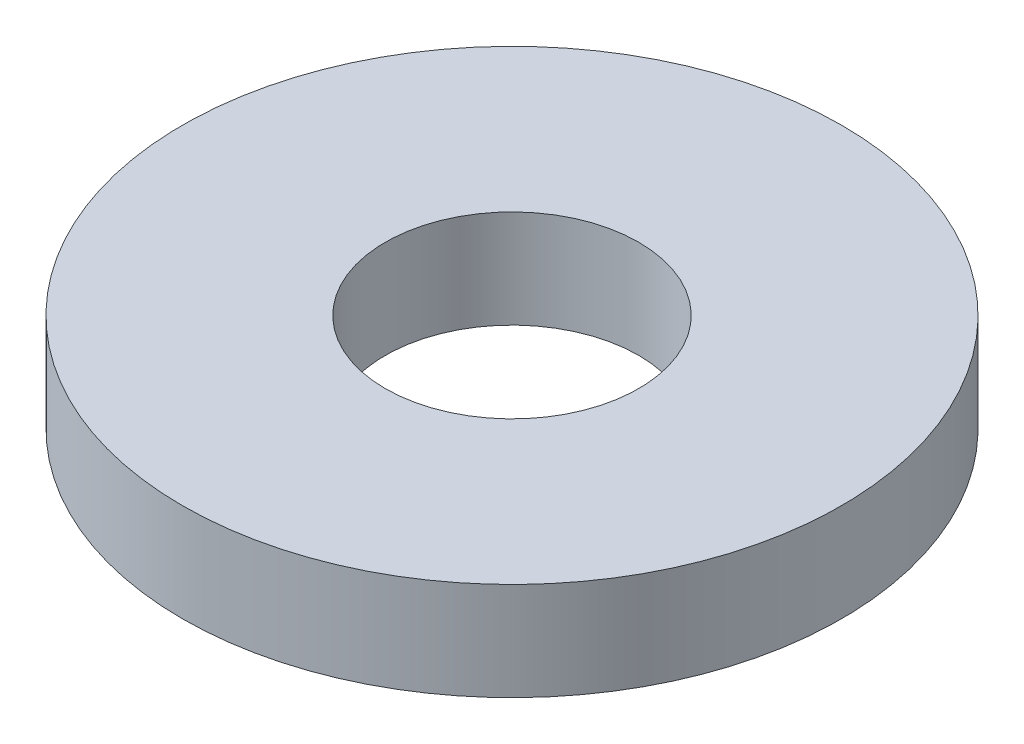
ISO-10303-21;
HEADER;
FILE_DESCRIPTION(('STEP AP214'),'2;1');
FILE_NAME('part.step','',(''),(''),'','','');
FILE_SCHEMA(('AUTOMOTIVE_DESIGN { 1 0 10303 214 1 1 1 1 }'));
ENDSEC;
DATA;
#1=APPLICATION_CONTEXT('core data for automotive mechanical design processes');
#2=APPLICATION_PROTOCOL_DEFINITION('international standard','automotive_design',2000,#1);
#3=PRODUCT_CONTEXT('',#1,'mechanical');
#4=PRODUCT('Part','Part','',(#3));
#5=PRODUCT_RELATED_PRODUCT_CATEGORY('part','',(#4));
#6=PRODUCT_DEFINITION_FORMATION('','',#4);
#7=PRODUCT_DEFINITION_CONTEXT('part definition',#1,'design');
#8=PRODUCT_DEFINITION('design','',#6,#7);
#9=PRODUCT_DEFINITION_SHAPE('','',#8);
#10=(LENGTH_UNIT() NAMED_UNIT(*) SI_UNIT(.MILLI.,.METRE.));
#11=(NAMED_UNIT(*) PLANE_ANGLE_UNIT() SI_UNIT($,.RADIAN.));
#12=(NAMED_UNIT(*) SI_UNIT($,.STERADIAN.) SOLID_ANGLE_UNIT());
#13=UNCERTAINTY_MEASURE_WITH_UNIT(LENGTH_MEASURE(1.E-05),#10,'distance_accuracy_value','');
#14=(GEOMETRIC_REPRESENTATION_CONTEXT(3) GLOBAL_UNCERTAINTY_ASSIGNED_CONTEXT((#13)) GLOBAL_UNIT_ASSIGNED_CONTEXT((#10,
#11,#12)) REPRESENTATION_CONTEXT('',''));
#15=CARTESIAN_POINT('',(0.,0.,0.));
#16=DIRECTION('',(0.,0.,1.));
#17=DIRECTION('',(1.,0.,0.));
#18=AXIS2_PLACEMENT_3D('',#15,#16,#17);
#19=CARTESIAN_POINT('',(0.,29.,0.));
#20=DIRECTION('',(0.,-1.,0.));
#21=DIRECTION('',(0.,0.,-1.));
#22=AXIS2_PLACEMENT_3D('',#19,#20,#21);
#23=CYLINDRICAL_SURFACE('',#22,97.5);
#24=CARTESIAN_POINT('',(0.,29.,0.));
#25=DIRECTION('',(0.,1.,0.));
#26=DIRECTION('',(0.,0.,1.));
#27=AXIS2_PLACEMENT_3D('',#24,#25,#26);
#28=CIRCLE('',#27,97.5);
#29=CARTESIAN_POINT('',(0.,29.,-97.5));
#30=VERTEX_POINT('',#29);
#31=EDGE_CURVE('E10',#30,#30,#28,.T.);
#32=CARTESIAN_POINT('',(0.,0.,0.));
#33=DIRECTION('',(0.,1.,0.));
#34=DIRECTION('',(0.,0.,1.));
#35=AXIS2_PLACEMENT_3D('',#32,#33,#34);
#36=CIRCLE('',#35,97.5);
#37=CARTESIAN_POINT('',(0.,0.,-97.5));
#38=VERTEX_POINT('',#37);
#39=EDGE_CURVE('E37',#38,#38,#36,.T.);
#40=CARTESIAN_POINT('',(0.,29.,-97.5));
#41=CARTESIAN_POINT('',(0.,28.6979166666667,-97.5));
#42=CARTESIAN_POINT('',(0.,28.3958333333333,-97.5));
#43=CARTESIAN_POINT('',(0.,27.7916666666667,-97.5));
#44=CARTESIAN_POINT('',(0.,27.4895833333333,-97.5));
#45=CARTESIAN_POINT('',(0.,26.8854166666667,-97.5));
#46=CARTESIAN_POINT('',(0.,26.5833333333333,-97.5));
#47=CARTESIAN_POINT('',(0.,25.9791666666667,-97.5));
#48=CARTESIAN_POINT('',(0.,25.6770833333333,-97.5));
#49=CARTESIAN_POINT('',(0.,25.0729166666667,-97.5));
#50=CARTESIAN_POINT('',(0.,24.7708333333333,-97.5));
#51=CARTESIAN_POINT('',(0.,24.1666666666667,-97.5));
#52=CARTESIAN_POINT('',(0.,23.8645833333333,-97.5));
#53=CARTESIAN_POINT('',(0.,23.2604166666667,-97.5));
#54=CARTESIAN_POINT('',(0.,22.9583333333333,-97.5));
#55=CARTESIAN_POINT('',(0.,22.3541666666667,-97.5));
#56=CARTESIAN_POINT('',(0.,22.0520833333333,-97.5));
#57=CARTESIAN_POINT('',(0.,21.4479166666667,-97.5));
#58=CARTESIAN_POINT('',(0.,21.1458333333333,-97.5));
#59=CARTESIAN_POINT('',(0.,20.5416666666667,-97.5));
#60=CARTESIAN_POINT('',(0.,20.2395833333333,-97.5));
#61=CARTESIAN_POINT('',(0.,19.6354166666667,-97.5));
#62=CARTESIAN_POINT('',(0.,19.3333333333333,-97.5));
#63=CARTESIAN_POINT('',(0.,18.7291666666667,-97.5));
#64=CARTESIAN_POINT('',(0.,18.4270833333333,-97.5));
#65=CARTESIAN_POINT('',(0.,17.8229166666667,-97.5));
#66=CARTESIAN_POINT('',(0.,17.5208333333333,-97.5));
#67=CARTESIAN_POINT('',(0.,16.9166666666667,-97.5));
#68=CARTESIAN_POINT('',(0.,16.6145833333333,-97.5));
#69=CARTESIAN_POINT('',(0.,16.0104166666667,-97.5));
#70=CARTESIAN_POINT('',(0.,15.7083333333333,-97.5));
#71=CARTESIAN_POINT('',(0.,15.1041666666667,-97.5));
#72=CARTESIAN_POINT('',(0.,14.8020833333333,-97.5));
#73=CARTESIAN_POINT('',(0.,14.1979166666667,-97.5));
#74=CARTESIAN_POINT('',(0.,13.8958333333333,-97.5));
#75=CARTESIAN_POINT('',(0.,13.2916666666667,-97.5));
#76=CARTESIAN_POINT('',(0.,12.9895833333333,-97.5));
#77=CARTESIAN_POINT('',(0.,12.3854166666667,-97.5));
#78=CARTESIAN_POINT('',(0.,12.0833333333333,-97.5));
#79=CARTESIAN_POINT('',(0.,11.4791666666667,-97.5));
#80=CARTESIAN_POINT('',(0.,11.1770833333333,-97.5));
#81=CARTESIAN_POINT('',(0.,10.5729166666667,-97.5));
#82=CARTESIAN_POINT('',(0.,10.2708333333333,-97.5));
#83=CARTESIAN_POINT('',(0.,9.66666666666667,-97.5));
#84=CARTESIAN_POINT('',(0.,9.36458333333333,-97.5));
#85=CARTESIAN_POINT('',(0.,8.76041666666667,-97.5));
#86=CARTESIAN_POINT('',(0.,8.45833333333333,-97.5));
#87=CARTESIAN_POINT('',(0.,7.85416666666667,-97.5));
#88=CARTESIAN_POINT('',(0.,7.55208333333333,-97.5));
#89=CARTESIAN_POINT('',(0.,6.94791666666667,-97.5));
#90=CARTESIAN_POINT('',(0.,6.64583333333333,-97.5));
#91=CARTESIAN_POINT('',(0.,6.04166666666667,-97.5));
#92=CARTESIAN_POINT('',(0.,5.73958333333333,-97.5));
#93=CARTESIAN_POINT('',(0.,5.13541666666667,-97.5));
#94=CARTESIAN_POINT('',(0.,4.83333333333333,-97.5));
#95=CARTESIAN_POINT('',(0.,4.22916666666667,-97.5));
#96=CARTESIAN_POINT('',(0.,3.92708333333333,-97.5));
#97=CARTESIAN_POINT('',(0.,3.32291666666667,-97.5));
#98=CARTESIAN_POINT('',(0.,3.02083333333333,-97.5));
#99=CARTESIAN_POINT('',(0.,2.41666666666667,-97.5));
#100=CARTESIAN_POINT('',(0.,2.11458333333333,-97.5));
#101=CARTESIAN_POINT('',(0.,1.51041666666667,-97.5));
#102=CARTESIAN_POINT('',(0.,1.20833333333333,-97.5));
#103=CARTESIAN_POINT('',(0.,0.604166666666667,-97.5));
#104=CARTESIAN_POINT('',(0.,0.302083333333333,-97.5));
#105=CARTESIAN_POINT('',(0.,0.,-97.5));
#106=B_SPLINE_CURVE_WITH_KNOTS('',3,(#40,#41,#42,#43,#44,#45,#46,#47,#48,#49,#50,#51,#52,#53,
#54,#55,#56,#57,#58,#59,#60,#61,#62,#63,#64,#65,#66,#67,#68,#69,#70,#71,#72,#73,#74,#75,#76,#77,
#78,#79,#80,#81,#82,#83,#84,#85,#86,#87,#88,#89,#90,#91,#92,#93,#94,#95,#96,#97,#98,#99,#100,
#101,#102,#103,#104,#105),.UNSPECIFIED.,.F.,.F.,(4,2,2,2,2,2,2,2,2,2,2,2,2,2,2,2,2,2,2,2,2,2,2,
2,2,2,2,2,2,2,2,2,4),(0.,0.906249999999997,1.8125,2.71875,3.625,4.53125,5.4375,6.34375,7.25,
8.15625,9.0625,9.96875,10.875,11.78125,12.6875,13.59375,14.5,15.40625,16.3125,17.21875,18.125,
19.03125,19.9375,20.84375,21.75,22.65625,23.5625,24.46875,25.375,26.28125,27.1875,28.09375,29.),.UNSPECIFIED.);
#107=EDGE_CURVE('BSEAM40',#30,#38,#106,.T.);
#108=ORIENTED_EDGE('',*,*,#31,.F.);
#109=ORIENTED_EDGE('',*,*,#39,.T.);
#110=ORIENTED_EDGE('',*,*,#107,.T.);
#111=ORIENTED_EDGE('',*,*,#107,.F.);
#112=EDGE_LOOP('',(#108,#110,#109,#111));
#113=FACE_BOUND('',#112,.T.);
#114=ADVANCED_FACE('F40',(#113),#23,.T.);
#115=CARTESIAN_POINT('',(0.,29.,0.));
#116=DIRECTION('',(0.,1.,0.));
#117=DIRECTION('',(0.,0.,1.));
#118=AXIS2_PLACEMENT_3D('',#115,#116,#117);
#119=PLANE('',#118);
#120=CARTESIAN_POINT('',(0.,29.,0.));
#121=DIRECTION('',(0.,1.,0.));
#122=DIRECTION('',(0.,0.,1.));
#123=AXIS2_PLACEMENT_3D('',#120,#121,#122);
#124=CIRCLE('',#123,37.5);
#125=CARTESIAN_POINT('',(0.,29.,-37.5));
#126=VERTEX_POINT('',#125);
#127=EDGE_CURVE('E50',#126,#126,#124,.T.);
#128=ORIENTED_EDGE('',*,*,#127,.F.);
#129=EDGE_LOOP('',(#128));
#130=FACE_BOUND('',#129,.T.);
#131=ORIENTED_EDGE('',*,*,#31,.T.);
#132=EDGE_LOOP('',(#131));
#133=FACE_BOUND('',#132,.T.);
#134=ADVANCED_FACE('F59',(#130,#133),#119,.T.);
#135=CARTESIAN_POINT('',(0.,0.,0.));
#136=DIRECTION('',(0.,1.,0.));
#137=DIRECTION('',(0.,0.,1.));
#138=AXIS2_PLACEMENT_3D('',#135,#136,#137);
#139=PLANE('',#138);
#140=CARTESIAN_POINT('',(0.,0.,0.));
#141=DIRECTION('',(0.,1.,0.));
#142=DIRECTION('',(0.,0.,1.));
#143=AXIS2_PLACEMENT_3D('',#140,#141,#142);
#144=CIRCLE('',#143,37.5);
#145=CARTESIAN_POINT('',(0.,0.,-37.5));
#146=VERTEX_POINT('',#145);
#147=EDGE_CURVE('E47',#146,#146,#144,.T.);
#148=ORIENTED_EDGE('',*,*,#147,.T.);
#149=EDGE_LOOP('',(#148));
#150=FACE_BOUND('',#149,.T.);
#151=ORIENTED_EDGE('',*,*,#39,.F.);
#152=EDGE_LOOP('',(#151));
#153=FACE_BOUND('',#152,.T.);
#154=ADVANCED_FACE('F58',(#150,#153),#139,.F.);
#155=CARTESIAN_POINT('',(0.,29.,0.));
#156=DIRECTION('',(0.,-1.,0.));
#157=DIRECTION('',(0.,0.,-1.));
#158=AXIS2_PLACEMENT_3D('',#155,#156,#157);
#159=CYLINDRICAL_SURFACE('',#158,37.5);
#160=CARTESIAN_POINT('',(0.,29.,-37.5));
#161=CARTESIAN_POINT('',(0.,28.6979166666667,-37.5));
#162=CARTESIAN_POINT('',(0.,28.3958333333333,-37.5));
#163=CARTESIAN_POINT('',(0.,27.7916666666667,-37.5));
#164=CARTESIAN_POINT('',(0.,27.4895833333333,-37.5));
#165=CARTESIAN_POINT('',(0.,26.8854166666667,-37.5));
#166=CARTESIAN_POINT('',(0.,26.5833333333333,-37.5));
#167=CARTESIAN_POINT('',(0.,25.9791666666667,-37.5));
#168=CARTESIAN_POINT('',(0.,25.6770833333333,-37.5));
#169=CARTESIAN_POINT('',(0.,25.0729166666667,-37.5));
#170=CARTESIAN_POINT('',(0.,24.7708333333333,-37.5));
#171=CARTESIAN_POINT('',(0.,24.1666666666667,-37.5));
#172=CARTESIAN_POINT('',(0.,23.8645833333333,-37.5));
#173=CARTESIAN_POINT('',(0.,23.2604166666667,-37.5));
#174=CARTESIAN_POINT('',(0.,22.9583333333333,-37.5));
#175=CARTESIAN_POINT('',(0.,22.3541666666667,-37.5));
#176=CARTESIAN_POINT('',(0.,22.0520833333333,-37.5));
#177=CARTESIAN_POINT('',(0.,21.4479166666667,-37.5));
#178=CARTESIAN_POINT('',(0.,21.1458333333333,-37.5));
#179=CARTESIAN_POINT('',(0.,20.5416666666667,-37.5));
#180=CARTESIAN_POINT('',(0.,20.2395833333333,-37.5));
#181=CARTESIAN_POINT('',(0.,19.6354166666667,-37.5));
#182=CARTESIAN_POINT('',(0.,19.3333333333333,-37.5));
#183=CARTESIAN_POINT('',(0.,18.7291666666667,-37.5));
#184=CARTESIAN_POINT('',(0.,18.4270833333333,-37.5));
#185=CARTESIAN_POINT('',(0.,17.8229166666667,-37.5));
#186=CARTESIAN_POINT('',(0.,17.5208333333333,-37.5));
#187=CARTESIAN_POINT('',(0.,16.9166666666667,-37.5));
#188=CARTESIAN_POINT('',(0.,16.6145833333333,-37.5));
#189=CARTESIAN_POINT('',(0.,16.0104166666667,-37.5));
#190=CARTESIAN_POINT('',(0.,15.7083333333333,-37.5));
#191=CARTESIAN_POINT('',(0.,15.1041666666667,-37.5));
#192=CARTESIAN_POINT('',(0.,14.8020833333333,-37.5));
#193=CARTESIAN_POINT('',(0.,14.1979166666667,-37.5));
#194=CARTESIAN_POINT('',(0.,13.8958333333333,-37.5));
#195=CARTESIAN_POINT('',(0.,13.2916666666667,-37.5));
#196=CARTESIAN_POINT('',(0.,12.9895833333333,-37.5));
#197=CARTESIAN_POINT('',(0.,12.3854166666667,-37.5));
#198=CARTESIAN_POINT('',(0.,12.0833333333333,-37.5));
#199=CARTESIAN_POINT('',(0.,11.4791666666667,-37.5));
#200=CARTESIAN_POINT('',(0.,11.1770833333333,-37.5));
#201=CARTESIAN_POINT('',(0.,10.5729166666667,-37.5));
#202=CARTESIAN_POINT('',(0.,10.2708333333333,-37.5));
#203=CARTESIAN_POINT('',(0.,9.66666666666667,-37.5));
#204=CARTESIAN_POINT('',(0.,9.36458333333333,-37.5));
#205=CARTESIAN_POINT('',(0.,8.76041666666667,-37.5));
#206=CARTESIAN_POINT('',(0.,8.45833333333333,-37.5));
#207=CARTESIAN_POINT('',(0.,7.85416666666667,-37.5));
#208=CARTESIAN_POINT('',(0.,7.55208333333333,-37.5));
#209=CARTESIAN_POINT('',(0.,6.94791666666667,-37.5));
#210=CARTESIAN_POINT('',(0.,6.64583333333333,-37.5));
#211=CARTESIAN_POINT('',(0.,6.04166666666667,-37.5));
#212=CARTESIAN_POINT('',(0.,5.73958333333333,-37.5));
#213=CARTESIAN_POINT('',(0.,5.13541666666667,-37.5));
#214=CARTESIAN_POINT('',(0.,4.83333333333333,-37.5));
#215=CARTESIAN_POINT('',(0.,4.22916666666667,-37.5));
#216=CARTESIAN_POINT('',(0.,3.92708333333333,-37.5));
#217=CARTESIAN_POINT('',(0.,3.32291666666667,-37.5));
#218=CARTESIAN_POINT('',(0.,3.02083333333333,-37.5));
#219=CARTESIAN_POINT('',(0.,2.41666666666667,-37.5));
#220=CARTESIAN_POINT('',(0.,2.11458333333333,-37.5));
#221=CARTESIAN_POINT('',(0.,1.51041666666667,-37.5));
#222=CARTESIAN_POINT('',(0.,1.20833333333333,-37.5));
#223=CARTESIAN_POINT('',(0.,0.604166666666667,-37.5));
#224=CARTESIAN_POINT('',(0.,0.302083333333333,-37.5));
#225=CARTESIAN_POINT('',(0.,0.,-37.5));
#226=B_SPLINE_CURVE_WITH_KNOTS('',3,(#160,#161,#162,#163,#164,#165,#166,#167,#168,#169,#170,
#171,#172,#173,#174,#175,#176,#177,#178,#179,#180,#181,#182,#183,#184,#185,#186,#187,#188,#189,
#190,#191,#192,#193,#194,#195,#196,#197,#198,#199,#200,#201,#202,#203,#204,#205,#206,#207,#208,
#209,#210,#211,#212,#213,#214,#215,#216,#217,#218,#219,#220,#221,#222,#223,#224,#225),
.UNSPECIFIED.,.F.,.F.,(4,2,2,2,2,2,2,2,2,2,2,2,2,2,2,2,2,2,2,2,2,2,2,2,2,2,2,2,2,2,2,2,4),(0.,
0.906249999999997,1.8125,2.71875,3.625,4.53125,5.4375,6.34375,7.25,8.15625,9.0625,9.96875,
10.875,11.78125,12.6875,13.59375,14.5,15.40625,16.3125,17.21875,18.125,19.03125,19.9375,
20.84375,21.75,22.65625,23.5625,24.46875,25.375,26.28125,27.1875,28.09375,29.),.UNSPECIFIED.);
#227=EDGE_CURVE('BSEAM54',#126,#146,#226,.T.);
#228=ORIENTED_EDGE('',*,*,#127,.T.);
#229=ORIENTED_EDGE('',*,*,#147,.F.);
#230=ORIENTED_EDGE('',*,*,#227,.T.);
#231=ORIENTED_EDGE('',*,*,#227,.F.);
#232=EDGE_LOOP('',(#228,#230,#229,#231));
#233=FACE_BOUND('',#232,.T.);
#234=ADVANCED_FACE('F54',(#233),#159,.F.);
#235=CLOSED_SHELL('',(#114,#134,#154,#234));
#236=MANIFOLD_SOLID_BREP('B2',#235);
#237=ADVANCED_BREP_SHAPE_REPRESENTATION('',(#18,#236),#14);
#238=SHAPE_DEFINITION_REPRESENTATION(#9,#237);
ENDSEC;
END-ISO-10303-21;
